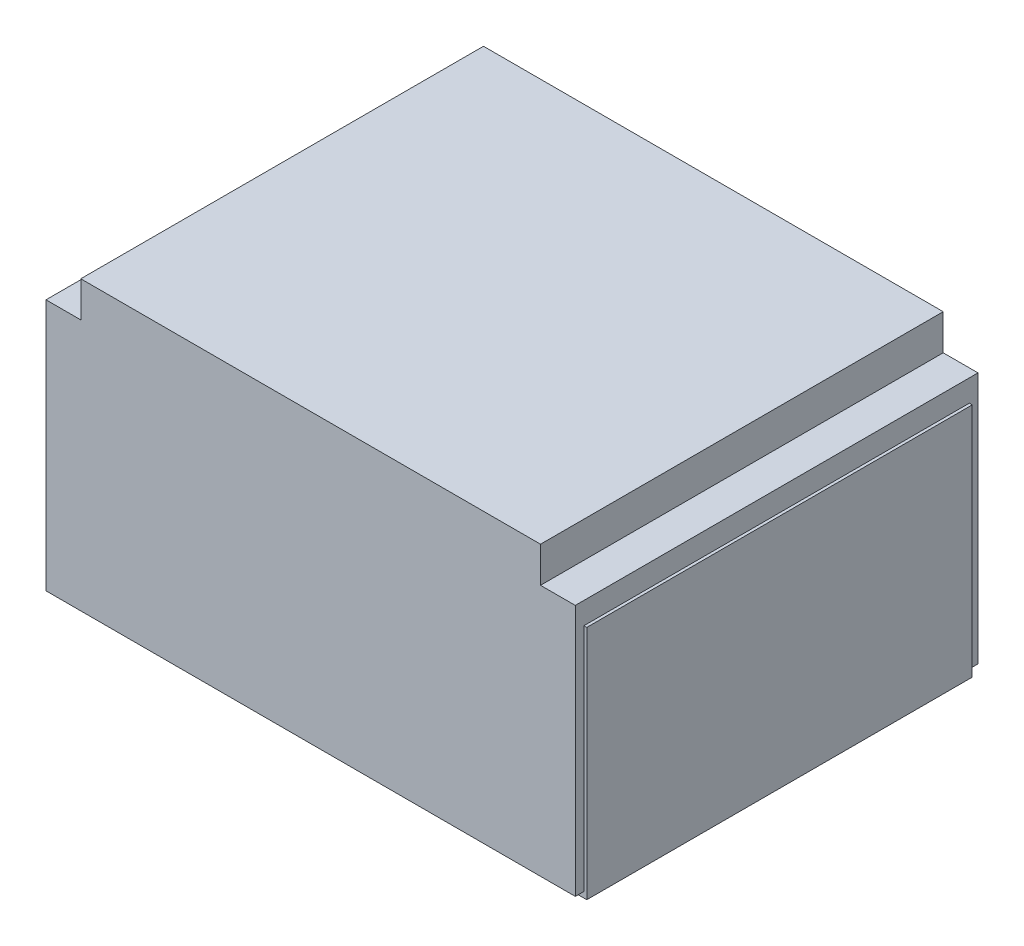
ISO-10303-21;
HEADER;
FILE_DESCRIPTION(('STEP AP214'),'2;1');
FILE_NAME('part.step','',(''),(''),'','','');
FILE_SCHEMA(('AUTOMOTIVE_DESIGN { 1 0 10303 214 1 1 1 1 }'));
ENDSEC;
DATA;
#1=APPLICATION_CONTEXT('core data for automotive mechanical design processes');
#2=APPLICATION_PROTOCOL_DEFINITION('international standard','automotive_design',2000,#1);
#3=PRODUCT_CONTEXT('',#1,'mechanical');
#4=PRODUCT('Part','Part','',(#3));
#5=PRODUCT_RELATED_PRODUCT_CATEGORY('part','',(#4));
#6=PRODUCT_DEFINITION_FORMATION('','',#4);
#7=PRODUCT_DEFINITION_CONTEXT('part definition',#1,'design');
#8=PRODUCT_DEFINITION('design','',#6,#7);
#9=PRODUCT_DEFINITION_SHAPE('','',#8);
#10=(LENGTH_UNIT() NAMED_UNIT(*) SI_UNIT(.MILLI.,.METRE.));
#11=(NAMED_UNIT(*) PLANE_ANGLE_UNIT() SI_UNIT($,.RADIAN.));
#12=(NAMED_UNIT(*) SI_UNIT($,.STERADIAN.) SOLID_ANGLE_UNIT());
#13=UNCERTAINTY_MEASURE_WITH_UNIT(LENGTH_MEASURE(1.E-05),#10,'distance_accuracy_value','');
#14=(GEOMETRIC_REPRESENTATION_CONTEXT(3) GLOBAL_UNCERTAINTY_ASSIGNED_CONTEXT((#13)) GLOBAL_UNIT_ASSIGNED_CONTEXT((#10,
#11,#12)) REPRESENTATION_CONTEXT('',''));
#15=CARTESIAN_POINT('',(0.,0.,0.));
#16=DIRECTION('',(0.,0.,1.));
#17=DIRECTION('',(1.,0.,0.));
#18=AXIS2_PLACEMENT_3D('',#15,#16,#17);
#19=CARTESIAN_POINT('',(0.,-1.65,1.59590093004976));
#20=DIRECTION('',(0.,1.,0.));
#21=DIRECTION('',(-1.,0.,0.));
#22=AXIS2_PLACEMENT_3D('',#19,#20,#21);
#23=CYLINDRICAL_SURFACE('',#22,1.);
#24=CARTESIAN_POINT('',(0.,-1.6,1.59590093004976));
#25=DIRECTION('',(0.,-1.,0.));
#26=DIRECTION('',(1.,0.,0.));
#27=AXIS2_PLACEMENT_3D('',#24,#25,#26);
#28=CIRCLE('',#27,1.);
#29=CARTESIAN_POINT('',(1.,-1.6,1.59590093004976));
#30=VERTEX_POINT('',#29);
#31=EDGE_CURVE('E11',#30,#30,#28,.F.);
#32=ORIENTED_EDGE('',*,*,#31,.T.);
#33=EDGE_LOOP('',(#32));
#34=FACE_BOUND('',#33,.T.);
#35=CARTESIAN_POINT('',(0.,-1.25,1.59590093004976));
#36=DIRECTION('',(0.,-1.,0.));
#37=DIRECTION('',(1.,0.,0.));
#38=AXIS2_PLACEMENT_3D('',#35,#36,#37);
#39=CIRCLE('',#38,1.);
#40=CARTESIAN_POINT('',(1.,-1.25,1.59590093004976));
#41=VERTEX_POINT('',#40);
#42=EDGE_CURVE('E61',#41,#41,#39,.T.);
#43=ORIENTED_EDGE('',*,*,#42,.T.);
#44=EDGE_LOOP('',(#43));
#45=FACE_BOUND('',#44,.T.);
#46=ADVANCED_FACE('F50',(#34,#45),#23,.T.);
#47=CARTESIAN_POINT('',(0.,-1.65,1.59590093004976));
#48=DIRECTION('',(0.,-1.,0.));
#49=DIRECTION('',(1.,0.,0.));
#50=AXIS2_PLACEMENT_3D('',#47,#48,#49);
#51=PLANE('',#50);
#52=CARTESIAN_POINT('',(0.,-1.65,1.59590093004976));
#53=DIRECTION('',(0.,-1.,0.));
#54=DIRECTION('',(1.,0.,0.));
#55=AXIS2_PLACEMENT_3D('',#52,#53,#54);
#56=CIRCLE('',#55,0.95);
#57=CARTESIAN_POINT('',(0.950000000000001,-1.65,1.59590093004976));
#58=VERTEX_POINT('',#57);
#59=EDGE_CURVE('E57',#58,#58,#56,.T.);
#60=ORIENTED_EDGE('',*,*,#59,.T.);
#61=EDGE_LOOP('',(#60));
#62=FACE_BOUND('',#61,.T.);
#63=ADVANCED_FACE('F71',(#62),#51,.T.);
#64=CARTESIAN_POINT('',(0.,-1.25,1.59590093004976));
#65=DIRECTION('',(0.,-1.,0.));
#66=DIRECTION('',(1.,0.,0.));
#67=AXIS2_PLACEMENT_3D('',#64,#65,#66);
#68=PLANE('',#67);
#69=ORIENTED_EDGE('',*,*,#42,.F.);
#70=EDGE_LOOP('',(#69));
#71=FACE_BOUND('',#70,.T.);
#72=ADVANCED_FACE('F69',(#71),#68,.F.);
#73=CARTESIAN_POINT('',(0.,-1.6,1.59590093004976));
#74=DIRECTION('',(0.,-1.,0.));
#75=DIRECTION('',(1.,0.,0.));
#76=AXIS2_PLACEMENT_3D('',#73,#74,#75);
#77=TOROIDAL_SURFACE('',#76,0.95,0.05);
#78=ORIENTED_EDGE('',*,*,#31,.F.);
#79=EDGE_LOOP('',(#78));
#80=FACE_BOUND('',#79,.T.);
#81=ORIENTED_EDGE('',*,*,#59,.F.);
#82=EDGE_LOOP('',(#81));
#83=FACE_BOUND('',#82,.T.);
#84=ADVANCED_FACE('F52',(#80,#83),#77,.T.);
#85=CLOSED_SHELL('',(#46,#63,#72,#84));
#86=MANIFOLD_SOLID_BREP('B2',#85);
#87=CARTESIAN_POINT('',(0.,-1.25,0.));
#88=DIRECTION('',(0.,1.,0.));
#89=DIRECTION('',(-1.,0.,0.));
#90=AXIS2_PLACEMENT_3D('',#87,#88,#89);
#91=PLANE('',#90);
#92=CARTESIAN_POINT('',(-1.92312305951284,-1.25,3.08939493928833));
#93=DIRECTION('',(0.,-1.,0.));
#94=DIRECTION('',(1.,0.,0.));
#95=AXIS2_PLACEMENT_3D('',#92,#93,#94);
#96=CIRCLE('',#95,0.162382368531784);
#97=CARTESIAN_POINT('',(-1.76074069098106,-1.25,3.08939493928833));
#98=VERTEX_POINT('',#97);
#99=EDGE_CURVE('E263',#98,#98,#96,.T.);
#100=ORIENTED_EDGE('',*,*,#99,.T.);
#101=EDGE_LOOP('',(#100));
#102=FACE_BOUND('',#101,.T.);
#103=CARTESIAN_POINT('',(0.,-1.25,1.59590093004976));
#104=DIRECTION('',(0.,-1.,0.));
#105=DIRECTION('',(1.,0.,0.));
#106=AXIS2_PLACEMENT_3D('',#103,#104,#105);
#107=CIRCLE('',#106,1.05);
#108=CARTESIAN_POINT('',(1.05,-1.25,1.59590093004976));
#109=VERTEX_POINT('',#108);
#110=EDGE_CURVE('E303',#109,#109,#107,.T.);
#111=ORIENTED_EDGE('',*,*,#110,.T.);
#112=EDGE_LOOP('',(#111));
#113=FACE_BOUND('',#112,.T.);
#114=CARTESIAN_POINT('',(1.92312305951285,-1.25,3.08939493928832));
#115=DIRECTION('',(0.,-1.,0.));
#116=DIRECTION('',(-1.,0.,0.));
#117=AXIS2_PLACEMENT_3D('',#114,#115,#116);
#118=CIRCLE('',#117,0.162382368531784);
#119=CARTESIAN_POINT('',(1.76074069098106,-1.25,3.08939493928832));
#120=VERTEX_POINT('',#119);
#121=EDGE_CURVE('E318',#120,#120,#118,.T.);
#122=ORIENTED_EDGE('',*,*,#121,.T.);
#123=EDGE_LOOP('',(#122));
#124=FACE_BOUND('',#123,.T.);
#125=DIRECTION('',(-1.,0.,0.));
#126=VECTOR('',#125,1.);
#127=CARTESIAN_POINT('',(-2.325,-1.25,3.425));
#128=LINE('',#127,#126);
#129=CARTESIAN_POINT('',(2.3,-1.25,3.425));
#130=VERTEX_POINT('',#129);
#131=CARTESIAN_POINT('',(-2.3,-1.25,3.425));
#132=VERTEX_POINT('',#131);
#133=EDGE_CURVE('E138',#130,#132,#128,.T.);
#134=ORIENTED_EDGE('',*,*,#133,.F.);
#135=DIRECTION('',(0.,0.,1.));
#136=VECTOR('',#135,1.);
#137=CARTESIAN_POINT('',(2.3,-1.25,3.425));
#138=LINE('',#137,#136);
#139=CARTESIAN_POINT('',(2.3,-1.25,0.0750000000000017));
#140=VERTEX_POINT('',#139);
#141=EDGE_CURVE('E241',#140,#130,#138,.T.);
#142=ORIENTED_EDGE('',*,*,#141,.F.);
#143=DIRECTION('',(1.,0.,0.));
#144=VECTOR('',#143,1.);
#145=CARTESIAN_POINT('',(-2.325,-1.25,0.075));
#146=LINE('',#145,#144);
#147=CARTESIAN_POINT('',(1.74824973955554,-1.25,0.0750000000000008));
#148=VERTEX_POINT('',#147);
#149=EDGE_CURVE('E253',#148,#140,#146,.T.);
#150=ORIENTED_EDGE('',*,*,#149,.F.);
#151=DIRECTION('',(0.,0.,1.));
#152=VECTOR('',#151,1.);
#153=CARTESIAN_POINT('',(1.74824973955554,-1.25,0.0750000000000008));
#154=LINE('',#153,#152);
#155=CARTESIAN_POINT('',(1.74824973955554,-1.25,0.44131323707769));
#156=VERTEX_POINT('',#155);
#157=EDGE_CURVE('E341',#148,#156,#154,.T.);
#158=ORIENTED_EDGE('',*,*,#157,.T.);
#159=DIRECTION('',(-1.,0.,0.));
#160=VECTOR('',#159,1.);
#161=CARTESIAN_POINT('',(1.74824973955554,-1.25,0.44131323707769));
#162=LINE('',#161,#160);
#163=CARTESIAN_POINT('',(1.64832212815136,-1.25,0.44131323707769));
#164=VERTEX_POINT('',#163);
#165=EDGE_CURVE('E146',#156,#164,#162,.T.);
#166=ORIENTED_EDGE('',*,*,#165,.T.);
#167=DIRECTION('',(-0.57346234436333,0.,-0.81923192051904));
#168=VECTOR('',#167,1.);
#169=CARTESIAN_POINT('',(1.64832212815136,-1.25,0.44131323707769));
#170=LINE('',#169,#168);
#171=CARTESIAN_POINT('',(1.47344880819406,-1.25,0.191494208567253));
#172=VERTEX_POINT('',#171);
#173=EDGE_CURVE('E369',#164,#172,#170,.T.);
#174=ORIENTED_EDGE('',*,*,#173,.T.);
#175=DIRECTION('',(-1.,0.,0.));
#176=VECTOR('',#175,1.);
#177=CARTESIAN_POINT('',(-1.47344880819406,-1.25,0.191494208567252));
#178=LINE('',#177,#176);
#179=CARTESIAN_POINT('',(-1.47344880819406,-1.25,0.191494208567252));
#180=VERTEX_POINT('',#179);
#181=EDGE_CURVE('E366',#172,#180,#178,.T.);
#182=ORIENTED_EDGE('',*,*,#181,.T.);
#183=DIRECTION('',(-0.573462344363329,0.,0.81923192051904));
#184=VECTOR('',#183,1.);
#185=CARTESIAN_POINT('',(-1.64832212815136,-1.25,0.441313237077689));
#186=LINE('',#185,#184);
#187=CARTESIAN_POINT('',(-1.64832212815136,-1.25,0.441313237077689));
#188=VERTEX_POINT('',#187);
#189=EDGE_CURVE('E363',#180,#188,#186,.T.);
#190=ORIENTED_EDGE('',*,*,#189,.T.);
#191=DIRECTION('',(-1.,0.,0.));
#192=VECTOR('',#191,1.);
#193=CARTESIAN_POINT('',(-1.74824973955554,-1.25,0.441313237077689));
#194=LINE('',#193,#192);
#195=CARTESIAN_POINT('',(-1.74824973955554,-1.25,0.441313237077689));
#196=VERTEX_POINT('',#195);
#197=EDGE_CURVE('E360',#188,#196,#194,.T.);
#198=ORIENTED_EDGE('',*,*,#197,.T.);
#199=DIRECTION('',(0.,0.,-1.));
#200=VECTOR('',#199,1.);
#201=CARTESIAN_POINT('',(-1.74824973955554,-1.25,0.075));
#202=LINE('',#201,#200);
#203=CARTESIAN_POINT('',(-1.74824973955554,-1.25,0.075));
#204=VERTEX_POINT('',#203);
#205=EDGE_CURVE('E323',#196,#204,#202,.T.);
#206=ORIENTED_EDGE('',*,*,#205,.T.);
#207=CARTESIAN_POINT('',(-2.3,-1.25,0.075));
#208=VERTEX_POINT('',#207);
#209=EDGE_CURVE('E260',#208,#204,#146,.T.);
#210=ORIENTED_EDGE('',*,*,#209,.F.);
#211=DIRECTION('',(0.,0.,-1.));
#212=VECTOR('',#211,1.);
#213=CARTESIAN_POINT('',(-2.3,-1.25,3.425));
#214=LINE('',#213,#212);
#215=EDGE_CURVE('E254',#132,#208,#214,.T.);
#216=ORIENTED_EDGE('',*,*,#215,.F.);
#217=EDGE_LOOP('',(#134,#142,#150,#158,#166,#174,#182,#190,#198,#206,#210,#216));
#218=FACE_BOUND('',#217,.T.);
#219=ADVANCED_FACE('F123',(#102,#113,#124,#218),#91,.T.);
#220=CARTESIAN_POINT('',(-2.325,-1.3,0.075));
#221=DIRECTION('',(0.,0.,1.));
#222=DIRECTION('',(1.,0.,0.));
#223=AXIS2_PLACEMENT_3D('',#220,#221,#222);
#224=PLANE('',#223);
#225=DIRECTION('',(0.,1.,0.));
#226=VECTOR('',#225,1.);
#227=CARTESIAN_POINT('',(-2.325,-1.3,0.075));
#228=LINE('',#227,#226);
#229=CARTESIAN_POINT('',(-2.325,-1.3,0.075));
#230=VERTEX_POINT('',#229);
#231=CARTESIAN_POINT('',(-2.325,0.75,0.075));
#232=VERTEX_POINT('',#231);
#233=EDGE_CURVE('E269',#230,#232,#228,.T.);
#234=ORIENTED_EDGE('',*,*,#233,.T.);
#235=DIRECTION('',(-1.,0.,0.));
#236=VECTOR('',#235,1.);
#237=CARTESIAN_POINT('',(-2.3,0.75,0.075));
#238=LINE('',#237,#236);
#239=CARTESIAN_POINT('',(-2.3,0.75,0.075));
#240=VERTEX_POINT('',#239);
#241=EDGE_CURVE('E286',#240,#232,#238,.T.);
#242=ORIENTED_EDGE('',*,*,#241,.F.);
#243=DIRECTION('',(0.,-1.,0.));
#244=VECTOR('',#243,1.);
#245=CARTESIAN_POINT('',(-2.3,0.75,0.075));
#246=LINE('',#245,#244);
#247=EDGE_CURVE('E294',#240,#208,#246,.T.);
#248=ORIENTED_EDGE('',*,*,#247,.T.);
#249=ORIENTED_EDGE('',*,*,#209,.T.);
#250=DIRECTION('',(0.,-1.,0.));
#251=VECTOR('',#250,1.);
#252=CARTESIAN_POINT('',(-1.74824973955554,-1.25,0.075));
#253=LINE('',#252,#251);
#254=CARTESIAN_POINT('',(-1.74824973955554,-1.3,0.075));
#255=VERTEX_POINT('',#254);
#256=EDGE_CURVE('E313',#204,#255,#253,.T.);
#257=ORIENTED_EDGE('',*,*,#256,.T.);
#258=DIRECTION('',(1.,0.,0.));
#259=VECTOR('',#258,1.);
#260=CARTESIAN_POINT('',(-2.325,-1.3,0.075));
#261=LINE('',#260,#259);
#262=EDGE_CURVE('E270',#230,#255,#261,.T.);
#263=ORIENTED_EDGE('',*,*,#262,.F.);
#264=EDGE_LOOP('',(#234,#242,#248,#249,#257,#263));
#265=FACE_BOUND('',#264,.T.);
#266=ADVANCED_FACE('F410',(#265),#224,.F.);
#267=CARTESIAN_POINT('',(2.325,-1.3,0.075));
#268=DIRECTION('',(-1.,0.,0.));
#269=DIRECTION('',(0.,-1.,0.));
#270=AXIS2_PLACEMENT_3D('',#267,#268,#269);
#271=PLANE('',#270);
#272=DIRECTION('',(0.,1.,0.));
#273=VECTOR('',#272,1.);
#274=CARTESIAN_POINT('',(2.325,-1.3,0.075));
#275=LINE('',#274,#273);
#276=CARTESIAN_POINT('',(2.325,-1.3,0.075));
#277=VERTEX_POINT('',#276);
#278=CARTESIAN_POINT('',(2.325,0.75,0.0750000000000017));
#279=VERTEX_POINT('',#278);
#280=EDGE_CURVE('E267',#277,#279,#275,.T.);
#281=ORIENTED_EDGE('',*,*,#280,.T.);
#282=DIRECTION('',(0.,0.,-1.));
#283=VECTOR('',#282,1.);
#284=CARTESIAN_POINT('',(2.325,0.75,0.0750000000000017));
#285=LINE('',#284,#283);
#286=CARTESIAN_POINT('',(2.325,0.75,3.425));
#287=VERTEX_POINT('',#286);
#288=EDGE_CURVE('E392',#287,#279,#285,.T.);
#289=ORIENTED_EDGE('',*,*,#288,.F.);
#290=DIRECTION('',(0.,1.,0.));
#291=VECTOR('',#290,1.);
#292=CARTESIAN_POINT('',(2.325,-1.3,3.425));
#293=LINE('',#292,#291);
#294=CARTESIAN_POINT('',(2.325,-1.3,3.425));
#295=VERTEX_POINT('',#294);
#296=EDGE_CURVE('E48',#295,#287,#293,.T.);
#297=ORIENTED_EDGE('',*,*,#296,.F.);
#298=DIRECTION('',(0.,0.,1.));
#299=VECTOR('',#298,1.);
#300=CARTESIAN_POINT('',(2.325,-1.3,0.075));
#301=LINE('',#300,#299);
#302=EDGE_CURVE('E262',#277,#295,#301,.T.);
#303=ORIENTED_EDGE('',*,*,#302,.F.);
#304=EDGE_LOOP('',(#281,#289,#297,#303));
#305=FACE_BOUND('',#304,.T.);
#306=ADVANCED_FACE('F125',(#305),#271,.F.);
#307=CARTESIAN_POINT('',(-2.325,-1.3,3.425));
#308=DIRECTION('',(0.,0.,-1.));
#309=DIRECTION('',(-1.,0.,0.));
#310=AXIS2_PLACEMENT_3D('',#307,#308,#309);
#311=PLANE('',#310);
#312=ORIENTED_EDGE('',*,*,#296,.T.);
#313=DIRECTION('',(1.,0.,0.));
#314=VECTOR('',#313,1.);
#315=CARTESIAN_POINT('',(2.325,0.75,3.425));
#316=LINE('',#315,#314);
#317=CARTESIAN_POINT('',(2.3,0.75,3.425));
#318=VERTEX_POINT('',#317);
#319=EDGE_CURVE('E394',#318,#287,#316,.T.);
#320=ORIENTED_EDGE('',*,*,#319,.F.);
#321=DIRECTION('',(0.,-1.,0.));
#322=VECTOR('',#321,1.);
#323=CARTESIAN_POINT('',(2.3,0.75,3.425));
#324=LINE('',#323,#322);
#325=EDGE_CURVE('E248',#318,#130,#324,.T.);
#326=ORIENTED_EDGE('',*,*,#325,.T.);
#327=ORIENTED_EDGE('',*,*,#133,.T.);
#328=DIRECTION('',(0.,-1.,0.));
#329=VECTOR('',#328,1.);
#330=CARTESIAN_POINT('',(-2.3,0.75,3.425));
#331=LINE('',#330,#329);
#332=CARTESIAN_POINT('',(-2.3,0.75,3.425));
#333=VERTEX_POINT('',#332);
#334=EDGE_CURVE('E290',#333,#132,#331,.T.);
#335=ORIENTED_EDGE('',*,*,#334,.F.);
#336=DIRECTION('',(1.,0.,0.));
#337=VECTOR('',#336,1.);
#338=CARTESIAN_POINT('',(-2.325,0.75,3.425));
#339=LINE('',#338,#337);
#340=CARTESIAN_POINT('',(-2.325,0.75,3.425));
#341=VERTEX_POINT('',#340);
#342=EDGE_CURVE('E284',#341,#333,#339,.T.);
#343=ORIENTED_EDGE('',*,*,#342,.F.);
#344=DIRECTION('',(0.,1.,0.));
#345=VECTOR('',#344,1.);
#346=CARTESIAN_POINT('',(-2.325,-1.3,3.425));
#347=LINE('',#346,#345);
#348=CARTESIAN_POINT('',(-2.325,-1.3,3.425));
#349=VERTEX_POINT('',#348);
#350=EDGE_CURVE('E131',#349,#341,#347,.T.);
#351=ORIENTED_EDGE('',*,*,#350,.F.);
#352=DIRECTION('',(-1.,0.,0.));
#353=VECTOR('',#352,1.);
#354=CARTESIAN_POINT('',(-2.325,-1.3,3.425));
#355=LINE('',#354,#353);
#356=EDGE_CURVE('E376',#295,#349,#355,.T.);
#357=ORIENTED_EDGE('',*,*,#356,.F.);
#358=EDGE_LOOP('',(#312,#320,#326,#327,#335,#343,#351,#357));
#359=FACE_BOUND('',#358,.T.);
#360=ADVANCED_FACE('F288',(#359),#311,.F.);
#361=CARTESIAN_POINT('',(-2.325,-1.3,0.075));
#362=DIRECTION('',(1.,0.,0.));
#363=DIRECTION('',(0.,1.,0.));
#364=AXIS2_PLACEMENT_3D('',#361,#362,#363);
#365=PLANE('',#364);
#366=ORIENTED_EDGE('',*,*,#350,.T.);
#367=DIRECTION('',(0.,0.,1.));
#368=VECTOR('',#367,1.);
#369=CARTESIAN_POINT('',(-2.325,0.75,0.075));
#370=LINE('',#369,#368);
#371=EDGE_CURVE('E278',#232,#341,#370,.T.);
#372=ORIENTED_EDGE('',*,*,#371,.F.);
#373=ORIENTED_EDGE('',*,*,#233,.F.);
#374=DIRECTION('',(0.,0.,-1.));
#375=VECTOR('',#374,1.);
#376=CARTESIAN_POINT('',(-2.325,-1.3,0.075));
#377=LINE('',#376,#375);
#378=EDGE_CURVE('E280',#349,#230,#377,.T.);
#379=ORIENTED_EDGE('',*,*,#378,.F.);
#380=EDGE_LOOP('',(#366,#372,#373,#379));
#381=FACE_BOUND('',#380,.T.);
#382=ADVANCED_FACE('F276',(#381),#365,.F.);
#383=CARTESIAN_POINT('',(1.74824973955554,-1.3,0.0750000000000008));
#384=VERTEX_POINT('',#383);
#385=EDGE_CURVE('E378',#384,#277,#261,.T.);
#386=ORIENTED_EDGE('',*,*,#385,.F.);
#387=DIRECTION('',(0.,-1.,0.));
#388=VECTOR('',#387,1.);
#389=CARTESIAN_POINT('',(1.74824973955554,-1.25,0.0750000000000008));
#390=LINE('',#389,#388);
#391=EDGE_CURVE('E259',#148,#384,#390,.T.);
#392=ORIENTED_EDGE('',*,*,#391,.F.);
#393=ORIENTED_EDGE('',*,*,#149,.T.);
#394=DIRECTION('',(0.,-1.,0.));
#395=VECTOR('',#394,1.);
#396=CARTESIAN_POINT('',(2.3,0.75,0.0750000000000017));
#397=LINE('',#396,#395);
#398=CARTESIAN_POINT('',(2.3,0.75,0.0750000000000017));
#399=VERTEX_POINT('',#398);
#400=EDGE_CURVE('E237',#399,#140,#397,.T.);
#401=ORIENTED_EDGE('',*,*,#400,.F.);
#402=DIRECTION('',(-1.,0.,0.));
#403=VECTOR('',#402,1.);
#404=CARTESIAN_POINT('',(2.3,0.75,0.0750000000000017));
#405=LINE('',#404,#403);
#406=EDGE_CURVE('E247',#279,#399,#405,.T.);
#407=ORIENTED_EDGE('',*,*,#406,.F.);
#408=ORIENTED_EDGE('',*,*,#280,.F.);
#409=EDGE_LOOP('',(#386,#392,#393,#401,#407,#408));
#410=FACE_BOUND('',#409,.T.);
#411=ADVANCED_FACE('F258',(#410),#224,.F.);
#412=CARTESIAN_POINT('',(0.,-1.3,0.));
#413=DIRECTION('',(0.,1.,0.));
#414=DIRECTION('',(-1.,0.,0.));
#415=AXIS2_PLACEMENT_3D('',#412,#413,#414);
#416=PLANE('',#415);
#417=CARTESIAN_POINT('',(-1.92312305951284,-1.3,3.08939493928833));
#418=DIRECTION('',(0.,-1.,0.));
#419=DIRECTION('',(1.,0.,0.));
#420=AXIS2_PLACEMENT_3D('',#417,#418,#419);
#421=CIRCLE('',#420,0.162382368531784);
#422=CARTESIAN_POINT('',(-1.76074069098106,-1.3,3.08939493928833));
#423=VERTEX_POINT('',#422);
#424=EDGE_CURVE('E306',#423,#423,#421,.T.);
#425=ORIENTED_EDGE('',*,*,#424,.F.);
#426=EDGE_LOOP('',(#425));
#427=FACE_BOUND('',#426,.T.);
#428=CARTESIAN_POINT('',(0.,-1.3,1.59590093004976));
#429=DIRECTION('',(0.,-1.,0.));
#430=DIRECTION('',(1.,0.,0.));
#431=AXIS2_PLACEMENT_3D('',#428,#429,#430);
#432=CIRCLE('',#431,1.05);
#433=CARTESIAN_POINT('',(1.05,-1.3,1.59590093004976));
#434=VERTEX_POINT('',#433);
#435=EDGE_CURVE('E310',#434,#434,#432,.T.);
#436=ORIENTED_EDGE('',*,*,#435,.F.);
#437=EDGE_LOOP('',(#436));
#438=FACE_BOUND('',#437,.T.);
#439=CARTESIAN_POINT('',(1.92312305951285,-1.3,3.08939493928832));
#440=DIRECTION('',(0.,-1.,0.));
#441=DIRECTION('',(-1.,0.,0.));
#442=AXIS2_PLACEMENT_3D('',#439,#440,#441);
#443=CIRCLE('',#442,0.162382368531784);
#444=CARTESIAN_POINT('',(1.76074069098106,-1.3,3.08939493928832));
#445=VERTEX_POINT('',#444);
#446=EDGE_CURVE('E309',#445,#445,#443,.T.);
#447=ORIENTED_EDGE('',*,*,#446,.F.);
#448=EDGE_LOOP('',(#447));
#449=FACE_BOUND('',#448,.T.);
#450=ORIENTED_EDGE('',*,*,#262,.T.);
#451=DIRECTION('',(0.,0.,-1.));
#452=VECTOR('',#451,1.);
#453=CARTESIAN_POINT('',(-1.74824973955554,-1.3,0.075));
#454=LINE('',#453,#452);
#455=CARTESIAN_POINT('',(-1.74824973955554,-1.3,0.441313237077689));
#456=VERTEX_POINT('',#455);
#457=EDGE_CURVE('E338',#456,#255,#454,.T.);
#458=ORIENTED_EDGE('',*,*,#457,.F.);
#459=DIRECTION('',(-1.,0.,0.));
#460=VECTOR('',#459,1.);
#461=CARTESIAN_POINT('',(-1.74824973955554,-1.3,0.441313237077689));
#462=LINE('',#461,#460);
#463=CARTESIAN_POINT('',(-1.64832212815136,-1.3,0.441313237077689));
#464=VERTEX_POINT('',#463);
#465=EDGE_CURVE('E340',#464,#456,#462,.T.);
#466=ORIENTED_EDGE('',*,*,#465,.F.);
#467=DIRECTION('',(-0.573462344363329,0.,0.81923192051904));
#468=VECTOR('',#467,1.);
#469=CARTESIAN_POINT('',(-1.64832212815136,-1.3,0.441313237077689));
#470=LINE('',#469,#468);
#471=CARTESIAN_POINT('',(-1.47344880819406,-1.3,0.191494208567252));
#472=VERTEX_POINT('',#471);
#473=EDGE_CURVE('E344',#472,#464,#470,.T.);
#474=ORIENTED_EDGE('',*,*,#473,.F.);
#475=DIRECTION('',(-1.,0.,0.));
#476=VECTOR('',#475,1.);
#477=CARTESIAN_POINT('',(-1.47344880819406,-1.3,0.191494208567252));
#478=LINE('',#477,#476);
#479=CARTESIAN_POINT('',(1.47344880819406,-1.3,0.191494208567253));
#480=VERTEX_POINT('',#479);
#481=EDGE_CURVE('E347',#480,#472,#478,.T.);
#482=ORIENTED_EDGE('',*,*,#481,.F.);
#483=DIRECTION('',(-0.57346234436333,0.,-0.81923192051904));
#484=VECTOR('',#483,1.);
#485=CARTESIAN_POINT('',(1.64832212815136,-1.3,0.44131323707769));
#486=LINE('',#485,#484);
#487=CARTESIAN_POINT('',(1.64832212815136,-1.3,0.44131323707769));
#488=VERTEX_POINT('',#487);
#489=EDGE_CURVE('E350',#488,#480,#486,.T.);
#490=ORIENTED_EDGE('',*,*,#489,.F.);
#491=DIRECTION('',(-1.,0.,0.));
#492=VECTOR('',#491,1.);
#493=CARTESIAN_POINT('',(1.74824973955554,-1.3,0.44131323707769));
#494=LINE('',#493,#492);
#495=CARTESIAN_POINT('',(1.74824973955554,-1.3,0.44131323707769));
#496=VERTEX_POINT('',#495);
#497=EDGE_CURVE('E353',#496,#488,#494,.T.);
#498=ORIENTED_EDGE('',*,*,#497,.F.);
#499=DIRECTION('',(0.,0.,1.));
#500=VECTOR('',#499,1.);
#501=CARTESIAN_POINT('',(1.74824973955554,-1.3,0.0750000000000008));
#502=LINE('',#501,#500);
#503=EDGE_CURVE('E321',#384,#496,#502,.T.);
#504=ORIENTED_EDGE('',*,*,#503,.F.);
#505=ORIENTED_EDGE('',*,*,#385,.T.);
#506=ORIENTED_EDGE('',*,*,#302,.T.);
#507=ORIENTED_EDGE('',*,*,#356,.T.);
#508=ORIENTED_EDGE('',*,*,#378,.T.);
#509=EDGE_LOOP('',(#450,#458,#466,#474,#482,#490,#498,#504,#505,#506,#507,#508));
#510=FACE_BOUND('',#509,.T.);
#511=ADVANCED_FACE('F385',(#427,#438,#449,#510),#416,.F.);
#512=CARTESIAN_POINT('',(1.92312305951285,-1.25,3.08939493928832));
#513=DIRECTION('',(0.,-1.,0.));
#514=DIRECTION('',(1.,0.,0.));
#515=AXIS2_PLACEMENT_3D('',#512,#513,#514);
#516=CYLINDRICAL_SURFACE('',#515,0.162382368531784);
#517=ORIENTED_EDGE('',*,*,#121,.F.);
#518=EDGE_LOOP('',(#517));
#519=FACE_BOUND('',#518,.T.);
#520=ORIENTED_EDGE('',*,*,#446,.T.);
#521=EDGE_LOOP('',(#520));
#522=FACE_BOUND('',#521,.T.);
#523=ADVANCED_FACE('F539',(#519,#522),#516,.F.);
#524=CARTESIAN_POINT('',(-1.74824973955554,-1.25,0.075));
#525=DIRECTION('',(-1.,0.,0.));
#526=DIRECTION('',(0.,-1.,0.));
#527=AXIS2_PLACEMENT_3D('',#524,#525,#526);
#528=PLANE('',#527);
#529=ORIENTED_EDGE('',*,*,#457,.T.);
#530=ORIENTED_EDGE('',*,*,#256,.F.);
#531=ORIENTED_EDGE('',*,*,#205,.F.);
#532=DIRECTION('',(0.,-1.,0.));
#533=VECTOR('',#532,1.);
#534=CARTESIAN_POINT('',(-1.74824973955554,-1.25,0.441313237077689));
#535=LINE('',#534,#533);
#536=EDGE_CURVE('E334',#196,#456,#535,.T.);
#537=ORIENTED_EDGE('',*,*,#536,.T.);
#538=EDGE_LOOP('',(#529,#530,#531,#537));
#539=FACE_BOUND('',#538,.T.);
#540=ADVANCED_FACE('F528',(#539),#528,.F.);
#541=CARTESIAN_POINT('',(-1.74824973955554,-1.25,0.441313237077689));
#542=DIRECTION('',(0.,0.,1.));
#543=DIRECTION('',(1.,0.,0.));
#544=AXIS2_PLACEMENT_3D('',#541,#542,#543);
#545=PLANE('',#544);
#546=ORIENTED_EDGE('',*,*,#465,.T.);
#547=ORIENTED_EDGE('',*,*,#536,.F.);
#548=ORIENTED_EDGE('',*,*,#197,.F.);
#549=DIRECTION('',(0.,-1.,0.));
#550=VECTOR('',#549,1.);
#551=CARTESIAN_POINT('',(-1.64832212815136,-1.25,0.441313237077689));
#552=LINE('',#551,#550);
#553=EDGE_CURVE('E332',#188,#464,#552,.T.);
#554=ORIENTED_EDGE('',*,*,#553,.T.);
#555=EDGE_LOOP('',(#546,#547,#548,#554));
#556=FACE_BOUND('',#555,.T.);
#557=ADVANCED_FACE('F517',(#556),#545,.F.);
#558=CARTESIAN_POINT('',(-1.64832212815136,-1.25,0.441313237077689));
#559=DIRECTION('',(0.81923192051904,0.,0.573462344363329));
#560=DIRECTION('',(0.573462344363329,0.,-0.81923192051904));
#561=AXIS2_PLACEMENT_3D('',#558,#559,#560);
#562=PLANE('',#561);
#563=ORIENTED_EDGE('',*,*,#473,.T.);
#564=ORIENTED_EDGE('',*,*,#553,.F.);
#565=ORIENTED_EDGE('',*,*,#189,.F.);
#566=DIRECTION('',(0.,-1.,0.));
#567=VECTOR('',#566,1.);
#568=CARTESIAN_POINT('',(-1.47344880819406,-1.25,0.191494208567252));
#569=LINE('',#568,#567);
#570=EDGE_CURVE('E330',#180,#472,#569,.T.);
#571=ORIENTED_EDGE('',*,*,#570,.T.);
#572=EDGE_LOOP('',(#563,#564,#565,#571));
#573=FACE_BOUND('',#572,.T.);
#574=ADVANCED_FACE('F506',(#573),#562,.F.);
#575=CARTESIAN_POINT('',(-1.47344880819406,-1.25,0.191494208567252));
#576=DIRECTION('',(0.,0.,1.));
#577=DIRECTION('',(1.,0.,0.));
#578=AXIS2_PLACEMENT_3D('',#575,#576,#577);
#579=PLANE('',#578);
#580=ORIENTED_EDGE('',*,*,#481,.T.);
#581=ORIENTED_EDGE('',*,*,#570,.F.);
#582=ORIENTED_EDGE('',*,*,#181,.F.);
#583=DIRECTION('',(0.,-1.,0.));
#584=VECTOR('',#583,1.);
#585=CARTESIAN_POINT('',(1.47344880819406,-1.25,0.191494208567253));
#586=LINE('',#585,#584);
#587=EDGE_CURVE('E328',#172,#480,#586,.T.);
#588=ORIENTED_EDGE('',*,*,#587,.T.);
#589=EDGE_LOOP('',(#580,#581,#582,#588));
#590=FACE_BOUND('',#589,.T.);
#591=ADVANCED_FACE('F495',(#590),#579,.F.);
#592=CARTESIAN_POINT('',(1.64832212815136,-1.25,0.44131323707769));
#593=DIRECTION('',(-0.81923192051904,0.,0.57346234436333));
#594=DIRECTION('',(0.57346234436333,0.,0.81923192051904));
#595=AXIS2_PLACEMENT_3D('',#592,#593,#594);
#596=PLANE('',#595);
#597=ORIENTED_EDGE('',*,*,#489,.T.);
#598=ORIENTED_EDGE('',*,*,#587,.F.);
#599=ORIENTED_EDGE('',*,*,#173,.F.);
#600=DIRECTION('',(0.,-1.,0.));
#601=VECTOR('',#600,1.);
#602=CARTESIAN_POINT('',(1.64832212815136,-1.25,0.44131323707769));
#603=LINE('',#602,#601);
#604=EDGE_CURVE('E326',#164,#488,#603,.T.);
#605=ORIENTED_EDGE('',*,*,#604,.T.);
#606=EDGE_LOOP('',(#597,#598,#599,#605));
#607=FACE_BOUND('',#606,.T.);
#608=ADVANCED_FACE('F485',(#607),#596,.F.);
#609=CARTESIAN_POINT('',(1.74824973955554,-1.25,0.44131323707769));
#610=DIRECTION('',(0.,0.,1.));
#611=DIRECTION('',(1.,0.,0.));
#612=AXIS2_PLACEMENT_3D('',#609,#610,#611);
#613=PLANE('',#612);
#614=ORIENTED_EDGE('',*,*,#497,.T.);
#615=ORIENTED_EDGE('',*,*,#604,.F.);
#616=ORIENTED_EDGE('',*,*,#165,.F.);
#617=DIRECTION('',(0.,-1.,0.));
#618=VECTOR('',#617,1.);
#619=CARTESIAN_POINT('',(1.74824973955554,-1.25,0.44131323707769));
#620=LINE('',#619,#618);
#621=EDGE_CURVE('E324',#156,#496,#620,.T.);
#622=ORIENTED_EDGE('',*,*,#621,.T.);
#623=EDGE_LOOP('',(#614,#615,#616,#622));
#624=FACE_BOUND('',#623,.T.);
#625=ADVANCED_FACE('F474',(#624),#613,.F.);
#626=CARTESIAN_POINT('',(1.74824973955554,-1.25,0.0750000000000008));
#627=DIRECTION('',(1.,0.,0.));
#628=DIRECTION('',(0.,0.,-1.));
#629=AXIS2_PLACEMENT_3D('',#626,#627,#628);
#630=PLANE('',#629);
#631=ORIENTED_EDGE('',*,*,#503,.T.);
#632=ORIENTED_EDGE('',*,*,#621,.F.);
#633=ORIENTED_EDGE('',*,*,#157,.F.);
#634=ORIENTED_EDGE('',*,*,#391,.T.);
#635=EDGE_LOOP('',(#631,#632,#633,#634));
#636=FACE_BOUND('',#635,.T.);
#637=ADVANCED_FACE('F463',(#636),#630,.F.);
#638=CARTESIAN_POINT('',(0.,-1.25,1.59590093004976));
#639=DIRECTION('',(0.,-1.,0.));
#640=DIRECTION('',(1.,0.,0.));
#641=AXIS2_PLACEMENT_3D('',#638,#639,#640);
#642=CYLINDRICAL_SURFACE('',#641,1.05);
#643=ORIENTED_EDGE('',*,*,#110,.F.);
#644=EDGE_LOOP('',(#643));
#645=FACE_BOUND('',#644,.T.);
#646=ORIENTED_EDGE('',*,*,#435,.T.);
#647=EDGE_LOOP('',(#646));
#648=FACE_BOUND('',#647,.T.);
#649=ADVANCED_FACE('F452',(#645,#648),#642,.F.);
#650=CARTESIAN_POINT('',(-1.92312305951284,-1.25,3.08939493928833));
#651=DIRECTION('',(0.,-1.,0.));
#652=DIRECTION('',(1.,0.,0.));
#653=AXIS2_PLACEMENT_3D('',#650,#651,#652);
#654=CYLINDRICAL_SURFACE('',#653,0.162382368531784);
#655=ORIENTED_EDGE('',*,*,#99,.F.);
#656=EDGE_LOOP('',(#655));
#657=FACE_BOUND('',#656,.T.);
#658=ORIENTED_EDGE('',*,*,#424,.T.);
#659=EDGE_LOOP('',(#658));
#660=FACE_BOUND('',#659,.T.);
#661=ADVANCED_FACE('F446',(#657,#660),#654,.F.);
#662=CARTESIAN_POINT('',(-2.3,0.75,3.425));
#663=DIRECTION('',(-1.,0.,0.));
#664=DIRECTION('',(0.,-1.,0.));
#665=AXIS2_PLACEMENT_3D('',#662,#663,#664);
#666=PLANE('',#665);
#667=ORIENTED_EDGE('',*,*,#215,.T.);
#668=ORIENTED_EDGE('',*,*,#247,.F.);
#669=DIRECTION('',(0.,0.,-1.));
#670=VECTOR('',#669,1.);
#671=CARTESIAN_POINT('',(-2.3,0.75,3.425));
#672=LINE('',#671,#670);
#673=EDGE_CURVE('E292',#333,#240,#672,.T.);
#674=ORIENTED_EDGE('',*,*,#673,.F.);
#675=ORIENTED_EDGE('',*,*,#334,.T.);
#676=EDGE_LOOP('',(#667,#668,#674,#675));
#677=FACE_BOUND('',#676,.T.);
#678=ADVANCED_FACE('F451',(#677),#666,.F.);
#679=CARTESIAN_POINT('',(0.,0.75,0.));
#680=DIRECTION('',(0.,1.,0.));
#681=DIRECTION('',(0.,0.,1.));
#682=AXIS2_PLACEMENT_3D('',#679,#680,#681);
#683=PLANE('',#682);
#684=ORIENTED_EDGE('',*,*,#241,.T.);
#685=ORIENTED_EDGE('',*,*,#371,.T.);
#686=ORIENTED_EDGE('',*,*,#342,.T.);
#687=ORIENTED_EDGE('',*,*,#673,.T.);
#688=EDGE_LOOP('',(#684,#685,#686,#687));
#689=FACE_BOUND('',#688,.T.);
#690=ADVANCED_FACE('F283',(#689),#683,.T.);
#691=CARTESIAN_POINT('',(2.3,0.75,3.425));
#692=DIRECTION('',(1.,0.,0.));
#693=DIRECTION('',(0.,1.,0.));
#694=AXIS2_PLACEMENT_3D('',#691,#692,#693);
#695=PLANE('',#694);
#696=ORIENTED_EDGE('',*,*,#141,.T.);
#697=ORIENTED_EDGE('',*,*,#325,.F.);
#698=DIRECTION('',(0.,0.,1.));
#699=VECTOR('',#698,1.);
#700=CARTESIAN_POINT('',(2.3,0.75,3.425));
#701=LINE('',#700,#699);
#702=EDGE_CURVE('E243',#399,#318,#701,.T.);
#703=ORIENTED_EDGE('',*,*,#702,.F.);
#704=ORIENTED_EDGE('',*,*,#400,.T.);
#705=EDGE_LOOP('',(#696,#697,#703,#704));
#706=FACE_BOUND('',#705,.T.);
#707=ADVANCED_FACE('F239',(#706),#695,.F.);
#708=CARTESIAN_POINT('',(0.,0.75,0.));
#709=DIRECTION('',(0.,-1.,0.));
#710=DIRECTION('',(0.,0.,-1.));
#711=AXIS2_PLACEMENT_3D('',#708,#709,#710);
#712=PLANE('',#711);
#713=ORIENTED_EDGE('',*,*,#702,.T.);
#714=ORIENTED_EDGE('',*,*,#319,.T.);
#715=ORIENTED_EDGE('',*,*,#288,.T.);
#716=ORIENTED_EDGE('',*,*,#406,.T.);
#717=EDGE_LOOP('',(#713,#714,#715,#716));
#718=FACE_BOUND('',#717,.T.);
#719=ADVANCED_FACE('F396',(#718),#712,.F.);
#720=CLOSED_SHELL('',(#219,#266,#306,#360,#382,#411,#511,#523,#540,#557,#574,#591,#608,#625,
#637,#649,#661,#678,#690,#707,#719));
#721=MANIFOLD_SOLID_BREP('B6',#720);
#722=CARTESIAN_POINT('',(-2.3,1.25,3.5));
#723=DIRECTION('',(1.,0.,0.));
#724=DIRECTION('',(0.,1.,0.));
#725=AXIS2_PLACEMENT_3D('',#722,#723,#724);
#726=PLANE('',#725);
#727=DIRECTION('',(0.,-1.,0.));
#728=VECTOR('',#727,1.);
#729=CARTESIAN_POINT('',(-2.3,1.25,3.5));
#730=LINE('',#729,#728);
#731=CARTESIAN_POINT('',(-2.3,0.940583691680877,3.5));
#732=VERTEX_POINT('',#731);
#733=CARTESIAN_POINT('',(-2.3,-1.25,3.5));
#734=VERTEX_POINT('',#733);
#735=EDGE_CURVE('E759',#732,#734,#730,.T.);
#736=ORIENTED_EDGE('',*,*,#735,.F.);
#737=DIRECTION('',(0.,0.,1.));
#738=VECTOR('',#737,1.);
#739=CARTESIAN_POINT('',(-2.3,0.940583691680877,0.));
#740=LINE('',#739,#738);
#741=CARTESIAN_POINT('',(-2.3,0.940583691680877,0.));
#742=VERTEX_POINT('',#741);
#743=EDGE_CURVE('E747',#742,#732,#740,.T.);
#744=ORIENTED_EDGE('',*,*,#743,.F.);
#745=DIRECTION('',(0.,-1.,0.));
#746=VECTOR('',#745,1.);
#747=CARTESIAN_POINT('',(-2.3,1.25,0.));
#748=LINE('',#747,#746);
#749=CARTESIAN_POINT('',(-2.3,-1.25,0.));
#750=VERTEX_POINT('',#749);
#751=EDGE_CURVE('E757',#742,#750,#748,.T.);
#752=ORIENTED_EDGE('',*,*,#751,.T.);
#753=DIRECTION('',(0.,0.,-1.));
#754=VECTOR('',#753,1.);
#755=CARTESIAN_POINT('',(-2.3,-1.25,3.5));
#756=LINE('',#755,#754);
#757=EDGE_CURVE('E121',#734,#750,#756,.T.);
#758=ORIENTED_EDGE('',*,*,#757,.F.);
#759=EDGE_LOOP('',(#736,#744,#752,#758));
#760=FACE_BOUND('',#759,.T.);
#761=ADVANCED_FACE('F679',(#760),#726,.F.);
#762=CARTESIAN_POINT('',(2.3,-1.25,3.5));
#763=DIRECTION('',(0.,1.,0.));
#764=DIRECTION('',(-1.,0.,0.));
#765=AXIS2_PLACEMENT_3D('',#762,#763,#764);
#766=PLANE('',#765);
#767=DIRECTION('',(1.,0.,0.));
#768=VECTOR('',#767,1.);
#769=CARTESIAN_POINT('',(2.3,-1.25,0.));
#770=LINE('',#769,#768);
#771=CARTESIAN_POINT('',(2.3,-1.25,0.));
#772=VERTEX_POINT('',#771);
#773=EDGE_CURVE('E763',#750,#772,#770,.T.);
#774=ORIENTED_EDGE('',*,*,#773,.T.);
#775=DIRECTION('',(0.,0.,-1.));
#776=VECTOR('',#775,1.);
#777=CARTESIAN_POINT('',(2.3,-1.25,3.5));
#778=LINE('',#777,#776);
#779=CARTESIAN_POINT('',(2.3,-1.25,3.5));
#780=VERTEX_POINT('',#779);
#781=EDGE_CURVE('E686',#780,#772,#778,.T.);
#782=ORIENTED_EDGE('',*,*,#781,.F.);
#783=DIRECTION('',(1.,0.,0.));
#784=VECTOR('',#783,1.);
#785=CARTESIAN_POINT('',(2.3,-1.25,3.5));
#786=LINE('',#785,#784);
#787=EDGE_CURVE('E789',#734,#780,#786,.T.);
#788=ORIENTED_EDGE('',*,*,#787,.F.);
#789=ORIENTED_EDGE('',*,*,#757,.T.);
#790=EDGE_LOOP('',(#774,#782,#788,#789));
#791=FACE_BOUND('',#790,.T.);
#792=ADVANCED_FACE('F823',(#791),#766,.F.);
#793=CARTESIAN_POINT('',(2.3,1.25,3.5));
#794=DIRECTION('',(-1.,0.,0.));
#795=DIRECTION('',(0.,-1.,0.));
#796=AXIS2_PLACEMENT_3D('',#793,#794,#795);
#797=PLANE('',#796);
#798=DIRECTION('',(0.,1.,0.));
#799=VECTOR('',#798,1.);
#800=CARTESIAN_POINT('',(2.3,1.25,0.));
#801=LINE('',#800,#799);
#802=CARTESIAN_POINT('',(2.3,0.940583691680892,0.));
#803=VERTEX_POINT('',#802);
#804=EDGE_CURVE('E766',#772,#803,#801,.T.);
#805=ORIENTED_EDGE('',*,*,#804,.T.);
#806=DIRECTION('',(0.,0.,1.));
#807=VECTOR('',#806,1.);
#808=CARTESIAN_POINT('',(2.3,0.940583691680877,0.));
#809=LINE('',#808,#807);
#810=CARTESIAN_POINT('',(2.3,0.940583691680877,3.5));
#811=VERTEX_POINT('',#810);
#812=EDGE_CURVE('E701',#803,#811,#809,.T.);
#813=ORIENTED_EDGE('',*,*,#812,.T.);
#814=DIRECTION('',(0.,1.,0.));
#815=VECTOR('',#814,1.);
#816=CARTESIAN_POINT('',(2.3,1.25,3.5));
#817=LINE('',#816,#815);
#818=EDGE_CURVE('E783',#780,#811,#817,.T.);
#819=ORIENTED_EDGE('',*,*,#818,.F.);
#820=ORIENTED_EDGE('',*,*,#781,.T.);
#821=EDGE_LOOP('',(#805,#813,#819,#820));
#822=FACE_BOUND('',#821,.T.);
#823=ADVANCED_FACE('F821',(#822),#797,.F.);
#824=CARTESIAN_POINT('',(2.3,1.25,3.5));
#825=DIRECTION('',(0.,-1.,0.));
#826=DIRECTION('',(1.,0.,0.));
#827=AXIS2_PLACEMENT_3D('',#824,#825,#826);
#828=PLANE('',#827);
#829=DIRECTION('',(-1.,0.,0.));
#830=VECTOR('',#829,1.);
#831=CARTESIAN_POINT('',(2.3,1.25,0.));
#832=LINE('',#831,#830);
#833=CARTESIAN_POINT('',(1.99779976113016,1.25,0.));
#834=VERTEX_POINT('',#833);
#835=CARTESIAN_POINT('',(-1.99779976113016,1.25,0.));
#836=VERTEX_POINT('',#835);
#837=EDGE_CURVE('E776',#834,#836,#832,.T.);
#838=ORIENTED_EDGE('',*,*,#837,.T.);
#839=DIRECTION('',(0.,0.,1.));
#840=VECTOR('',#839,1.);
#841=CARTESIAN_POINT('',(-1.99779976113016,1.25,0.));
#842=LINE('',#841,#840);
#843=CARTESIAN_POINT('',(-1.99779976113016,1.25,3.5));
#844=VERTEX_POINT('',#843);
#845=EDGE_CURVE('E764',#836,#844,#842,.T.);
#846=ORIENTED_EDGE('',*,*,#845,.T.);
#847=DIRECTION('',(-1.,0.,0.));
#848=VECTOR('',#847,1.);
#849=CARTESIAN_POINT('',(2.3,1.25,3.5));
#850=LINE('',#849,#848);
#851=CARTESIAN_POINT('',(1.99779976113016,1.25,3.5));
#852=VERTEX_POINT('',#851);
#853=EDGE_CURVE('E771',#852,#844,#850,.T.);
#854=ORIENTED_EDGE('',*,*,#853,.F.);
#855=DIRECTION('',(0.,0.,1.));
#856=VECTOR('',#855,1.);
#857=CARTESIAN_POINT('',(1.99779976113016,1.25,0.));
#858=LINE('',#857,#856);
#859=EDGE_CURVE('E806',#834,#852,#858,.T.);
#860=ORIENTED_EDGE('',*,*,#859,.F.);
#861=EDGE_LOOP('',(#838,#846,#854,#860));
#862=FACE_BOUND('',#861,.T.);
#863=ADVANCED_FACE('F816',(#862),#828,.F.);
#864=CARTESIAN_POINT('',(0.,0.,3.5));
#865=DIRECTION('',(0.,0.,-1.));
#866=DIRECTION('',(-1.,0.,0.));
#867=AXIS2_PLACEMENT_3D('',#864,#865,#866);
#868=PLANE('',#867);
#869=ORIENTED_EDGE('',*,*,#853,.T.);
#870=DIRECTION('',(0.,1.,0.));
#871=VECTOR('',#870,1.);
#872=CARTESIAN_POINT('',(-1.99779976113016,0.940583691680877,3.5));
#873=LINE('',#872,#871);
#874=CARTESIAN_POINT('',(-1.99779976113016,0.940583691680877,3.5));
#875=VERTEX_POINT('',#874);
#876=EDGE_CURVE('E752',#875,#844,#873,.T.);
#877=ORIENTED_EDGE('',*,*,#876,.F.);
#878=DIRECTION('',(1.,0.,0.));
#879=VECTOR('',#878,1.);
#880=CARTESIAN_POINT('',(-2.3,0.940583691680877,3.5));
#881=LINE('',#880,#879);
#882=EDGE_CURVE('E804',#732,#875,#881,.T.);
#883=ORIENTED_EDGE('',*,*,#882,.F.);
#884=ORIENTED_EDGE('',*,*,#735,.T.);
#885=ORIENTED_EDGE('',*,*,#787,.T.);
#886=ORIENTED_EDGE('',*,*,#818,.T.);
#887=DIRECTION('',(1.,0.,0.));
#888=VECTOR('',#887,1.);
#889=CARTESIAN_POINT('',(2.3,0.940583691680877,3.5));
#890=LINE('',#889,#888);
#891=CARTESIAN_POINT('',(1.99779976113017,0.940583691680907,3.5));
#892=VERTEX_POINT('',#891);
#893=EDGE_CURVE('E797',#892,#811,#890,.T.);
#894=ORIENTED_EDGE('',*,*,#893,.F.);
#895=DIRECTION('',(0.,-1.,0.));
#896=VECTOR('',#895,1.);
#897=CARTESIAN_POINT('',(1.99779976113017,0.940583691680907,3.5));
#898=LINE('',#897,#896);
#899=EDGE_CURVE('E801',#852,#892,#898,.T.);
#900=ORIENTED_EDGE('',*,*,#899,.F.);
#901=EDGE_LOOP('',(#869,#877,#883,#884,#885,#886,#894,#900));
#902=FACE_BOUND('',#901,.T.);
#903=ADVANCED_FACE('F819',(#902),#868,.F.);
#904=CARTESIAN_POINT('',(0.,0.,0.));
#905=DIRECTION('',(0.,0.,-1.));
#906=DIRECTION('',(-1.,0.,0.));
#907=AXIS2_PLACEMENT_3D('',#904,#905,#906);
#908=PLANE('',#907);
#909=DIRECTION('',(0.,1.,0.));
#910=VECTOR('',#909,1.);
#911=CARTESIAN_POINT('',(-1.99779976113016,0.940583691680877,0.));
#912=LINE('',#911,#910);
#913=CARTESIAN_POINT('',(-1.99779976113016,0.940583691680877,0.));
#914=VERTEX_POINT('',#913);
#915=EDGE_CURVE('E693',#914,#836,#912,.T.);
#916=ORIENTED_EDGE('',*,*,#915,.T.);
#917=ORIENTED_EDGE('',*,*,#837,.F.);
#918=DIRECTION('',(0.,-1.,0.));
#919=VECTOR('',#918,1.);
#920=CARTESIAN_POINT('',(1.99779976113017,0.940583691680907,0.));
#921=LINE('',#920,#919);
#922=CARTESIAN_POINT('',(1.99779976113017,0.940583691680907,0.));
#923=VERTEX_POINT('',#922);
#924=EDGE_CURVE('E794',#834,#923,#921,.T.);
#925=ORIENTED_EDGE('',*,*,#924,.T.);
#926=DIRECTION('',(1.,0.,0.));
#927=VECTOR('',#926,1.);
#928=CARTESIAN_POINT('',(2.3,0.940583691680877,0.));
#929=LINE('',#928,#927);
#930=EDGE_CURVE('E798',#923,#803,#929,.T.);
#931=ORIENTED_EDGE('',*,*,#930,.T.);
#932=ORIENTED_EDGE('',*,*,#804,.F.);
#933=ORIENTED_EDGE('',*,*,#773,.F.);
#934=ORIENTED_EDGE('',*,*,#751,.F.);
#935=DIRECTION('',(1.,0.,0.));
#936=VECTOR('',#935,1.);
#937=CARTESIAN_POINT('',(-2.3,0.940583691680877,0.));
#938=LINE('',#937,#936);
#939=EDGE_CURVE('E743',#742,#914,#938,.T.);
#940=ORIENTED_EDGE('',*,*,#939,.T.);
#941=EDGE_LOOP('',(#916,#917,#925,#931,#932,#933,#934,#940));
#942=FACE_BOUND('',#941,.T.);
#943=ADVANCED_FACE('F761',(#942),#908,.T.);
#944=CARTESIAN_POINT('',(1.99779976113017,0.940583691680907,0.));
#945=DIRECTION('',(-1.,0.,0.));
#946=DIRECTION('',(0.,-1.,0.));
#947=AXIS2_PLACEMENT_3D('',#944,#945,#946);
#948=PLANE('',#947);
#949=ORIENTED_EDGE('',*,*,#899,.T.);
#950=DIRECTION('',(0.,0.,1.));
#951=VECTOR('',#950,1.);
#952=CARTESIAN_POINT('',(1.99779976113017,0.940583691680907,0.));
#953=LINE('',#952,#951);
#954=EDGE_CURVE('E800',#923,#892,#953,.T.);
#955=ORIENTED_EDGE('',*,*,#954,.F.);
#956=ORIENTED_EDGE('',*,*,#924,.F.);
#957=ORIENTED_EDGE('',*,*,#859,.T.);
#958=EDGE_LOOP('',(#949,#955,#956,#957));
#959=FACE_BOUND('',#958,.T.);
#960=ADVANCED_FACE('F818',(#959),#948,.F.);
#961=CARTESIAN_POINT('',(2.3,0.940583691680877,0.));
#962=DIRECTION('',(0.,-1.,0.));
#963=DIRECTION('',(1.,0.,0.));
#964=AXIS2_PLACEMENT_3D('',#961,#962,#963);
#965=PLANE('',#964);
#966=ORIENTED_EDGE('',*,*,#893,.T.);
#967=ORIENTED_EDGE('',*,*,#812,.F.);
#968=ORIENTED_EDGE('',*,*,#930,.F.);
#969=ORIENTED_EDGE('',*,*,#954,.T.);
#970=EDGE_LOOP('',(#966,#967,#968,#969));
#971=FACE_BOUND('',#970,.T.);
#972=ADVANCED_FACE('F820',(#971),#965,.F.);
#973=CARTESIAN_POINT('',(-1.99779976113016,0.940583691680877,0.));
#974=DIRECTION('',(1.,0.,0.));
#975=DIRECTION('',(0.,0.,-1.));
#976=AXIS2_PLACEMENT_3D('',#973,#974,#975);
#977=PLANE('',#976);
#978=ORIENTED_EDGE('',*,*,#876,.T.);
#979=ORIENTED_EDGE('',*,*,#845,.F.);
#980=ORIENTED_EDGE('',*,*,#915,.F.);
#981=DIRECTION('',(0.,0.,1.));
#982=VECTOR('',#981,1.);
#983=CARTESIAN_POINT('',(-1.99779976113016,0.940583691680877,0.));
#984=LINE('',#983,#982);
#985=EDGE_CURVE('E749',#914,#875,#984,.T.);
#986=ORIENTED_EDGE('',*,*,#985,.T.);
#987=EDGE_LOOP('',(#978,#979,#980,#986));
#988=FACE_BOUND('',#987,.T.);
#989=ADVANCED_FACE('F894',(#988),#977,.F.);
#990=CARTESIAN_POINT('',(-2.3,0.940583691680877,0.));
#991=DIRECTION('',(0.,-1.,0.));
#992=DIRECTION('',(0.,0.,-1.));
#993=AXIS2_PLACEMENT_3D('',#990,#991,#992);
#994=PLANE('',#993);
#995=ORIENTED_EDGE('',*,*,#882,.T.);
#996=ORIENTED_EDGE('',*,*,#985,.F.);
#997=ORIENTED_EDGE('',*,*,#939,.F.);
#998=ORIENTED_EDGE('',*,*,#743,.T.);
#999=EDGE_LOOP('',(#995,#996,#997,#998));
#1000=FACE_BOUND('',#999,.T.);
#1001=ADVANCED_FACE('F746',(#1000),#994,.F.);
#1002=CLOSED_SHELL('',(#761,#792,#823,#863,#903,#943,#960,#972,#989,#1001));
#1003=MANIFOLD_SOLID_BREP('B42',#1002);
#1004=ADVANCED_BREP_SHAPE_REPRESENTATION('',(#18,#86,#721,#1003),#14);
#1005=SHAPE_DEFINITION_REPRESENTATION(#9,#1004);
ENDSEC;
END-ISO-10303-21;
